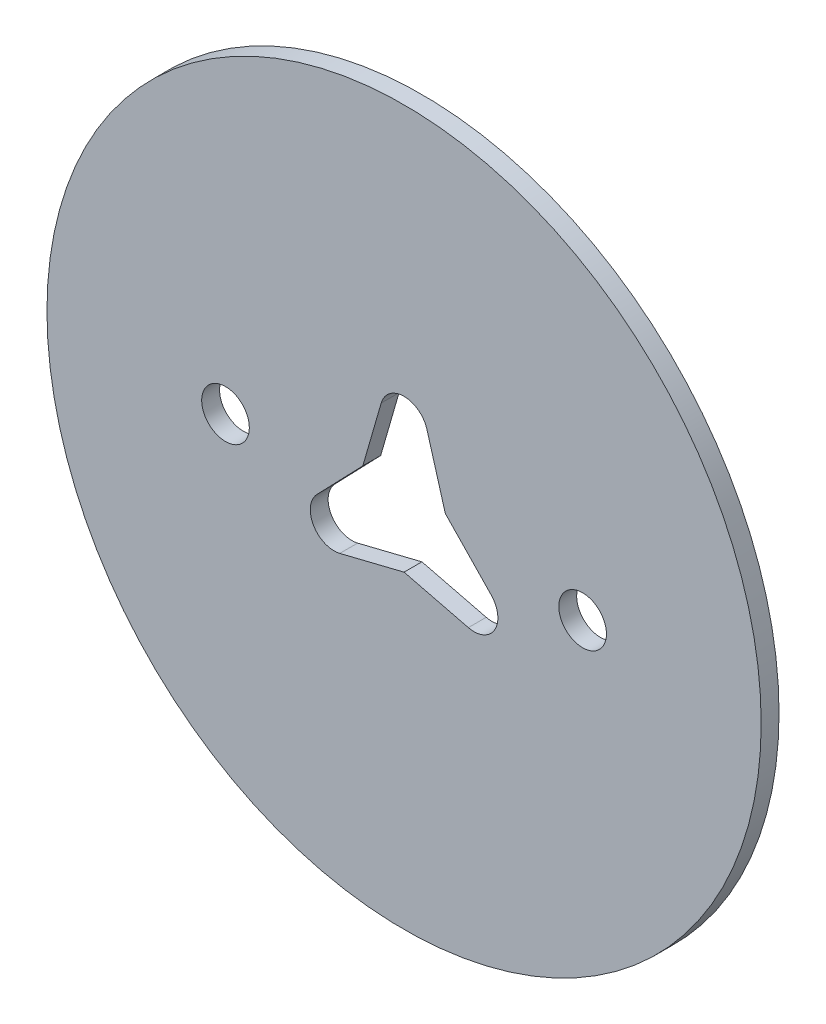
ISO-10303-21;
HEADER;
FILE_DESCRIPTION(('STEP AP214'),'2;1');
FILE_NAME('part.step','',(''),(''),'','','');
FILE_SCHEMA(('AUTOMOTIVE_DESIGN { 1 0 10303 214 1 1 1 1 }'));
ENDSEC;
DATA;
#1=APPLICATION_CONTEXT('core data for automotive mechanical design processes');
#2=APPLICATION_PROTOCOL_DEFINITION('international standard','automotive_design',2000,#1);
#3=PRODUCT_CONTEXT('',#1,'mechanical');
#4=PRODUCT('Part','Part','',(#3));
#5=PRODUCT_RELATED_PRODUCT_CATEGORY('part','',(#4));
#6=PRODUCT_DEFINITION_FORMATION('','',#4);
#7=PRODUCT_DEFINITION_CONTEXT('part definition',#1,'design');
#8=PRODUCT_DEFINITION('design','',#6,#7);
#9=PRODUCT_DEFINITION_SHAPE('','',#8);
#10=(LENGTH_UNIT() NAMED_UNIT(*) SI_UNIT(.MILLI.,.METRE.));
#11=(NAMED_UNIT(*) PLANE_ANGLE_UNIT() SI_UNIT($,.RADIAN.));
#12=(NAMED_UNIT(*) SI_UNIT($,.STERADIAN.) SOLID_ANGLE_UNIT());
#13=UNCERTAINTY_MEASURE_WITH_UNIT(LENGTH_MEASURE(1.E-05),#10,'distance_accuracy_value','');
#14=(GEOMETRIC_REPRESENTATION_CONTEXT(3) GLOBAL_UNCERTAINTY_ASSIGNED_CONTEXT((#13)) GLOBAL_UNIT_ASSIGNED_CONTEXT((#10,
#11,#12)) REPRESENTATION_CONTEXT('',''));
#15=CARTESIAN_POINT('',(0.,0.,0.));
#16=DIRECTION('',(0.,0.,1.));
#17=DIRECTION('',(1.,0.,0.));
#18=AXIS2_PLACEMENT_3D('',#15,#16,#17);
#19=CARTESIAN_POINT('',(0.,0.,1.5));
#20=DIRECTION('',(0.,0.,1.));
#21=DIRECTION('',(1.,0.,0.));
#22=AXIS2_PLACEMENT_3D('',#19,#20,#21);
#23=PLANE('',#22);
#24=CARTESIAN_POINT('',(-15.,0.,1.5));
#25=DIRECTION('',(0.,0.,1.));
#26=DIRECTION('',(1.,0.,0.));
#27=AXIS2_PLACEMENT_3D('',#24,#25,#26);
#28=CIRCLE('',#27,2.);
#29=CARTESIAN_POINT('',(-13.,0.,1.5));
#30=VERTEX_POINT('',#29);
#31=EDGE_CURVE('E159',#30,#30,#28,.T.);
#32=ORIENTED_EDGE('',*,*,#31,.F.);
#33=EDGE_LOOP('',(#32));
#34=FACE_BOUND('',#33,.T.);
#35=CARTESIAN_POINT('',(0.,0.,1.5));
#36=DIRECTION('',(0.,0.,1.));
#37=DIRECTION('',(1.,0.,0.));
#38=AXIS2_PLACEMENT_3D('',#35,#36,#37);
#39=CIRCLE('',#38,30.);
#40=CARTESIAN_POINT('',(30.,0.,1.5));
#41=VERTEX_POINT('',#40);
#42=EDGE_CURVE('E165',#41,#41,#39,.T.);
#43=ORIENTED_EDGE('',*,*,#42,.T.);
#44=EDGE_LOOP('',(#43));
#45=FACE_BOUND('',#44,.T.);
#46=CARTESIAN_POINT('',(15.,0.,1.5));
#47=DIRECTION('',(0.,0.,1.));
#48=DIRECTION('',(1.,0.,0.));
#49=AXIS2_PLACEMENT_3D('',#46,#47,#48);
#50=CIRCLE('',#49,2.);
#51=CARTESIAN_POINT('',(17.,0.,1.5));
#52=VERTEX_POINT('',#51);
#53=EDGE_CURVE('E153',#52,#52,#50,.T.);
#54=ORIENTED_EDGE('',*,*,#53,.F.);
#55=EDGE_LOOP('',(#54));
#56=FACE_BOUND('',#55,.T.);
#57=DIRECTION('',(0.97072534339415,0.240192230707636,0.));
#58=VECTOR('',#57,1.);
#59=CARTESIAN_POINT('',(0.932642742537106,-3.76923076923076,1.5));
#60=LINE('',#59,#58);
#61=CARTESIAN_POINT('',(-5.39897319316845,-5.33589941132433,1.5));
#62=VERTEX_POINT('',#61);
#63=CARTESIAN_POINT('',(0.,-4.,1.5));
#64=VERTEX_POINT('',#63);
#65=EDGE_CURVE('E120',#62,#64,#60,.T.);
#66=ORIENTED_EDGE('',*,*,#65,.F.);
#67=CARTESIAN_POINT('',(-5.87935765458372,-3.39444872453603,1.5));
#68=DIRECTION('',(0.,0.,1.));
#69=DIRECTION('',(1.,0.,0.));
#70=AXIS2_PLACEMENT_3D('',#67,#68,#69);
#71=CIRCLE('',#70,2.);
#72=CARTESIAN_POINT('',(-7.32051103882952,-2.00769823397297,1.5));
#73=VERTEX_POINT('',#72);
#74=EDGE_CURVE('E187',#62,#73,#71,.F.);
#75=ORIENTED_EDGE('',*,*,#74,.T.);
#76=DIRECTION('',(0.693375245281533,0.720576692122896,0.));
#77=VECTOR('',#76,1.);
#78=CARTESIAN_POINT('',(-2.79792822761128,2.69230769230768,1.5));
#79=LINE('',#78,#77);
#80=CARTESIAN_POINT('',(-3.46410161513776,1.99999999999999,1.5));
#81=VERTEX_POINT('',#80);
#82=EDGE_CURVE('E150',#73,#81,#79,.T.);
#83=ORIENTED_EDGE('',*,*,#82,.T.);
#84=DIRECTION('',(0.277350098112615,0.960768922830523,0.));
#85=VECTOR('',#84,1.);
#86=CARTESIAN_POINT('',(-3.73057097014835,1.07692307692308,1.5));
#87=LINE('',#86,#85);
#88=CARTESIAN_POINT('',(-1.92153784566104,7.34359764529726,1.5));
#89=VERTEX_POINT('',#88);
#90=EDGE_CURVE('E121',#81,#89,#87,.T.);
#91=ORIENTED_EDGE('',*,*,#90,.T.);
#92=CARTESIAN_POINT('',(0.,6.78889744907202,1.5));
#93=DIRECTION('',(0.,0.,1.));
#94=DIRECTION('',(1.,0.,0.));
#95=AXIS2_PLACEMENT_3D('',#92,#93,#94);
#96=CIRCLE('',#95,2.);
#97=CARTESIAN_POINT('',(1.92153784566105,7.34359764529726,1.5));
#98=VERTEX_POINT('',#97);
#99=EDGE_CURVE('E11',#89,#98,#96,.F.);
#100=ORIENTED_EDGE('',*,*,#99,.T.);
#101=DIRECTION('',(0.277350098112615,-0.960768922830523,0.));
#102=VECTOR('',#101,1.);
#103=CARTESIAN_POINT('',(3.73057097014835,1.07692307692308,1.5));
#104=LINE('',#103,#102);
#105=CARTESIAN_POINT('',(3.46410161513776,1.99999999999999,1.5));
#106=VERTEX_POINT('',#105);
#107=EDGE_CURVE('E142',#98,#106,#104,.T.);
#108=ORIENTED_EDGE('',*,*,#107,.T.);
#109=DIRECTION('',(0.693375245281533,-0.720576692122896,0.));
#110=VECTOR('',#109,1.);
#111=CARTESIAN_POINT('',(2.79792822761128,2.69230769230768,1.5));
#112=LINE('',#111,#110);
#113=CARTESIAN_POINT('',(7.32051103882952,-2.00769823397297,1.5));
#114=VERTEX_POINT('',#113);
#115=EDGE_CURVE('E144',#106,#114,#112,.T.);
#116=ORIENTED_EDGE('',*,*,#115,.T.);
#117=CARTESIAN_POINT('',(5.87935765458372,-3.39444872453604,1.5));
#118=DIRECTION('',(0.,0.,1.));
#119=DIRECTION('',(1.,0.,0.));
#120=AXIS2_PLACEMENT_3D('',#117,#118,#119);
#121=CIRCLE('',#120,2.);
#122=CARTESIAN_POINT('',(5.39897319316845,-5.33589941132434,1.5));
#123=VERTEX_POINT('',#122);
#124=EDGE_CURVE('E184',#114,#123,#121,.F.);
#125=ORIENTED_EDGE('',*,*,#124,.T.);
#126=DIRECTION('',(0.97072534339415,-0.240192230707636,0.));
#127=VECTOR('',#126,1.);
#128=CARTESIAN_POINT('',(-0.932642742537106,-3.76923076923076,1.5));
#129=LINE('',#128,#127);
#130=EDGE_CURVE('E147',#64,#123,#129,.T.);
#131=ORIENTED_EDGE('',*,*,#130,.F.);
#132=EDGE_LOOP('',(#66,#75,#83,#91,#100,#108,#116,#125,#131));
#133=FACE_BOUND('',#132,.T.);
#134=ADVANCED_FACE('F32',(#34,#45,#56,#133),#23,.T.);
#135=CARTESIAN_POINT('',(0.,0.,0.));
#136=DIRECTION('',(0.,0.,1.));
#137=DIRECTION('',(1.,0.,0.));
#138=AXIS2_PLACEMENT_3D('',#135,#136,#137);
#139=PLANE('',#138);
#140=CARTESIAN_POINT('',(15.,0.,0.));
#141=DIRECTION('',(0.,0.,1.));
#142=DIRECTION('',(1.,0.,0.));
#143=AXIS2_PLACEMENT_3D('',#140,#141,#142);
#144=CIRCLE('',#143,2.);
#145=CARTESIAN_POINT('',(17.,0.,0.));
#146=VERTEX_POINT('',#145);
#147=EDGE_CURVE('E152',#146,#146,#144,.T.);
#148=ORIENTED_EDGE('',*,*,#147,.T.);
#149=EDGE_LOOP('',(#148));
#150=FACE_BOUND('',#149,.T.);
#151=CARTESIAN_POINT('',(-15.,0.,0.));
#152=DIRECTION('',(0.,0.,1.));
#153=DIRECTION('',(1.,0.,0.));
#154=AXIS2_PLACEMENT_3D('',#151,#152,#153);
#155=CIRCLE('',#154,2.);
#156=CARTESIAN_POINT('',(-13.,0.,0.));
#157=VERTEX_POINT('',#156);
#158=EDGE_CURVE('E156',#157,#157,#155,.T.);
#159=ORIENTED_EDGE('',*,*,#158,.T.);
#160=EDGE_LOOP('',(#159));
#161=FACE_BOUND('',#160,.T.);
#162=CARTESIAN_POINT('',(0.,0.,0.));
#163=DIRECTION('',(0.,0.,1.));
#164=DIRECTION('',(1.,0.,0.));
#165=AXIS2_PLACEMENT_3D('',#162,#163,#164);
#166=CIRCLE('',#165,30.);
#167=CARTESIAN_POINT('',(30.,0.,0.));
#168=VERTEX_POINT('',#167);
#169=EDGE_CURVE('E162',#168,#168,#166,.T.);
#170=ORIENTED_EDGE('',*,*,#169,.F.);
#171=EDGE_LOOP('',(#170));
#172=FACE_BOUND('',#171,.T.);
#173=DIRECTION('',(-0.693375245281533,-0.720576692122896,0.));
#174=VECTOR('',#173,1.);
#175=CARTESIAN_POINT('',(-3.46410161513776,1.99999999999999,0.));
#176=LINE('',#175,#174);
#177=CARTESIAN_POINT('',(-3.46410161513776,1.99999999999999,0.));
#178=VERTEX_POINT('',#177);
#179=CARTESIAN_POINT('',(-7.32051103882952,-2.00769823397297,0.));
#180=VERTEX_POINT('',#179);
#181=EDGE_CURVE('E127',#178,#180,#176,.T.);
#182=ORIENTED_EDGE('',*,*,#181,.T.);
#183=CARTESIAN_POINT('',(-5.87935765458372,-3.39444872453603,0.));
#184=DIRECTION('',(0.,0.,1.));
#185=DIRECTION('',(1.,0.,0.));
#186=AXIS2_PLACEMENT_3D('',#183,#184,#185);
#187=CIRCLE('',#186,2.);
#188=CARTESIAN_POINT('',(-5.39897319316845,-5.33589941132433,0.));
#189=VERTEX_POINT('',#188);
#190=EDGE_CURVE('E126',#180,#189,#187,.T.);
#191=ORIENTED_EDGE('',*,*,#190,.T.);
#192=DIRECTION('',(-0.97072534339415,-0.240192230707636,0.));
#193=VECTOR('',#192,1.);
#194=CARTESIAN_POINT('',(0.,-4.,0.));
#195=LINE('',#194,#193);
#196=CARTESIAN_POINT('',(0.,-4.,0.));
#197=VERTEX_POINT('',#196);
#198=EDGE_CURVE('E113',#197,#189,#195,.T.);
#199=ORIENTED_EDGE('',*,*,#198,.F.);
#200=DIRECTION('',(-0.97072534339415,0.240192230707636,0.));
#201=VECTOR('',#200,1.);
#202=CARTESIAN_POINT('',(12.1243556529821,-7.00000000000006,0.));
#203=LINE('',#202,#201);
#204=CARTESIAN_POINT('',(5.39897319316845,-5.33589941132434,0.));
#205=VERTEX_POINT('',#204);
#206=EDGE_CURVE('E103',#205,#197,#203,.T.);
#207=ORIENTED_EDGE('',*,*,#206,.F.);
#208=CARTESIAN_POINT('',(5.87935765458372,-3.39444872453604,0.));
#209=DIRECTION('',(0.,0.,1.));
#210=DIRECTION('',(1.,0.,0.));
#211=AXIS2_PLACEMENT_3D('',#208,#209,#210);
#212=CIRCLE('',#211,2.);
#213=CARTESIAN_POINT('',(7.32051103882952,-2.00769823397297,0.));
#214=VERTEX_POINT('',#213);
#215=EDGE_CURVE('E182',#205,#214,#212,.T.);
#216=ORIENTED_EDGE('',*,*,#215,.T.);
#217=DIRECTION('',(-0.693375245281533,0.720576692122896,0.));
#218=VECTOR('',#217,1.);
#219=CARTESIAN_POINT('',(12.1243556529821,-7.00000000000006,0.));
#220=LINE('',#219,#218);
#221=CARTESIAN_POINT('',(3.46410161513776,1.99999999999999,0.));
#222=VERTEX_POINT('',#221);
#223=EDGE_CURVE('E112',#214,#222,#220,.T.);
#224=ORIENTED_EDGE('',*,*,#223,.T.);
#225=DIRECTION('',(-0.277350098112615,0.960768922830523,0.));
#226=VECTOR('',#225,1.);
#227=CARTESIAN_POINT('',(3.46410161513776,1.99999999999999,0.));
#228=LINE('',#227,#226);
#229=CARTESIAN_POINT('',(1.92153784566105,7.34359764529726,0.));
#230=VERTEX_POINT('',#229);
#231=EDGE_CURVE('E132',#222,#230,#228,.T.);
#232=ORIENTED_EDGE('',*,*,#231,.T.);
#233=CARTESIAN_POINT('',(0.,6.78889744907202,0.));
#234=DIRECTION('',(0.,0.,1.));
#235=DIRECTION('',(1.,0.,0.));
#236=AXIS2_PLACEMENT_3D('',#233,#234,#235);
#237=CIRCLE('',#236,2.);
#238=CARTESIAN_POINT('',(-1.92153784566105,7.34359764529726,0.));
#239=VERTEX_POINT('',#238);
#240=EDGE_CURVE('E40',#230,#239,#237,.T.);
#241=ORIENTED_EDGE('',*,*,#240,.T.);
#242=DIRECTION('',(-0.277350098112615,-0.960768922830523,0.));
#243=VECTOR('',#242,1.);
#244=CARTESIAN_POINT('',(0.,14.,0.));
#245=LINE('',#244,#243);
#246=EDGE_CURVE('E134',#239,#178,#245,.T.);
#247=ORIENTED_EDGE('',*,*,#246,.T.);
#248=EDGE_LOOP('',(#182,#191,#199,#207,#216,#224,#232,#241,#247));
#249=FACE_BOUND('',#248,.T.);
#250=ADVANCED_FACE('F125',(#150,#161,#172,#249),#139,.F.);
#251=CARTESIAN_POINT('',(0.,0.,1.5));
#252=DIRECTION('',(0.,0.,-1.));
#253=DIRECTION('',(-1.,0.,0.));
#254=AXIS2_PLACEMENT_3D('',#251,#252,#253);
#255=CYLINDRICAL_SURFACE('',#254,30.);
#256=ORIENTED_EDGE('',*,*,#42,.F.);
#257=EDGE_LOOP('',(#256));
#258=FACE_BOUND('',#257,.T.);
#259=ORIENTED_EDGE('',*,*,#169,.T.);
#260=EDGE_LOOP('',(#259));
#261=FACE_BOUND('',#260,.T.);
#262=ADVANCED_FACE('F214',(#258,#261),#255,.T.);
#263=CARTESIAN_POINT('',(-15.,0.,1.5));
#264=DIRECTION('',(0.,0.,-1.));
#265=DIRECTION('',(-1.,0.,0.));
#266=AXIS2_PLACEMENT_3D('',#263,#264,#265);
#267=CYLINDRICAL_SURFACE('',#266,2.);
#268=ORIENTED_EDGE('',*,*,#31,.T.);
#269=EDGE_LOOP('',(#268));
#270=FACE_BOUND('',#269,.T.);
#271=ORIENTED_EDGE('',*,*,#158,.F.);
#272=EDGE_LOOP('',(#271));
#273=FACE_BOUND('',#272,.T.);
#274=ADVANCED_FACE('F220',(#270,#273),#267,.F.);
#275=CARTESIAN_POINT('',(15.,0.,1.5));
#276=DIRECTION('',(0.,0.,-1.));
#277=DIRECTION('',(-1.,0.,0.));
#278=AXIS2_PLACEMENT_3D('',#275,#276,#277);
#279=CYLINDRICAL_SURFACE('',#278,2.);
#280=ORIENTED_EDGE('',*,*,#53,.T.);
#281=EDGE_LOOP('',(#280));
#282=FACE_BOUND('',#281,.T.);
#283=ORIENTED_EDGE('',*,*,#147,.F.);
#284=EDGE_LOOP('',(#283));
#285=FACE_BOUND('',#284,.T.);
#286=ADVANCED_FACE('F228',(#282,#285),#279,.F.);
#287=CARTESIAN_POINT('',(-3.46410161513776,1.99999999999999,10.));
#288=DIRECTION('',(0.720576692122896,-0.693375245281533,0.));
#289=DIRECTION('',(0.693375245281533,0.720576692122896,0.));
#290=AXIS2_PLACEMENT_3D('',#287,#288,#289);
#291=PLANE('',#290);
#292=ORIENTED_EDGE('',*,*,#82,.F.);
#293=DIRECTION('',(0.,0.,-1.));
#294=VECTOR('',#293,1.);
#295=CARTESIAN_POINT('',(-7.32051103882952,-2.00769823397297,10.));
#296=LINE('',#295,#294);
#297=EDGE_CURVE('E173',#73,#180,#296,.T.);
#298=ORIENTED_EDGE('',*,*,#297,.T.);
#299=ORIENTED_EDGE('',*,*,#181,.F.);
#300=DIRECTION('',(0.,0.,-1.));
#301=VECTOR('',#300,1.);
#302=CARTESIAN_POINT('',(-3.46410161513776,1.99999999999999,10.));
#303=LINE('',#302,#301);
#304=EDGE_CURVE('E136',#81,#178,#303,.T.);
#305=ORIENTED_EDGE('',*,*,#304,.F.);
#306=EDGE_LOOP('',(#292,#298,#299,#305));
#307=FACE_BOUND('',#306,.T.);
#308=ADVANCED_FACE('F195',(#307),#291,.T.);
#309=CARTESIAN_POINT('',(0.,-4.,10.));
#310=DIRECTION('',(0.240192230707636,-0.97072534339415,0.));
#311=DIRECTION('',(0.97072534339415,0.240192230707636,0.));
#312=AXIS2_PLACEMENT_3D('',#309,#310,#311);
#313=PLANE('',#312);
#314=ORIENTED_EDGE('',*,*,#198,.T.);
#315=DIRECTION('',(0.,0.,-1.));
#316=VECTOR('',#315,1.);
#317=CARTESIAN_POINT('',(-5.39897319316845,-5.33589941132433,10.));
#318=LINE('',#317,#316);
#319=EDGE_CURVE('E176',#189,#62,#318,.F.);
#320=ORIENTED_EDGE('',*,*,#319,.T.);
#321=ORIENTED_EDGE('',*,*,#65,.T.);
#322=DIRECTION('',(0.,0.,-1.));
#323=VECTOR('',#322,1.);
#324=CARTESIAN_POINT('',(0.,-4.,10.));
#325=LINE('',#324,#323);
#326=EDGE_CURVE('E107',#64,#197,#325,.T.);
#327=ORIENTED_EDGE('',*,*,#326,.T.);
#328=EDGE_LOOP('',(#314,#320,#321,#327));
#329=FACE_BOUND('',#328,.T.);
#330=ADVANCED_FACE('F117',(#329),#313,.F.);
#331=CARTESIAN_POINT('',(12.1243556529821,-7.00000000000006,10.));
#332=DIRECTION('',(-0.240192230707636,-0.97072534339415,0.));
#333=DIRECTION('',(0.97072534339415,-0.240192230707636,0.));
#334=AXIS2_PLACEMENT_3D('',#331,#332,#333);
#335=PLANE('',#334);
#336=ORIENTED_EDGE('',*,*,#130,.T.);
#337=DIRECTION('',(0.,0.,-1.));
#338=VECTOR('',#337,1.);
#339=CARTESIAN_POINT('',(5.39897319316845,-5.33589941132434,10.));
#340=LINE('',#339,#338);
#341=EDGE_CURVE('E110',#123,#205,#340,.T.);
#342=ORIENTED_EDGE('',*,*,#341,.T.);
#343=ORIENTED_EDGE('',*,*,#206,.T.);
#344=ORIENTED_EDGE('',*,*,#326,.F.);
#345=EDGE_LOOP('',(#336,#342,#343,#344));
#346=FACE_BOUND('',#345,.T.);
#347=ADVANCED_FACE('F106',(#346),#335,.F.);
#348=CARTESIAN_POINT('',(12.1243556529821,-7.00000000000006,10.));
#349=DIRECTION('',(-0.720576692122896,-0.693375245281533,0.));
#350=DIRECTION('',(0.693375245281533,-0.720576692122896,0.));
#351=AXIS2_PLACEMENT_3D('',#348,#349,#350);
#352=PLANE('',#351);
#353=ORIENTED_EDGE('',*,*,#223,.F.);
#354=DIRECTION('',(0.,0.,-1.));
#355=VECTOR('',#354,1.);
#356=CARTESIAN_POINT('',(7.32051103882952,-2.00769823397297,10.));
#357=LINE('',#356,#355);
#358=EDGE_CURVE('E171',#214,#114,#357,.F.);
#359=ORIENTED_EDGE('',*,*,#358,.T.);
#360=ORIENTED_EDGE('',*,*,#115,.F.);
#361=DIRECTION('',(0.,0.,-1.));
#362=VECTOR('',#361,1.);
#363=CARTESIAN_POINT('',(3.46410161513776,1.99999999999999,10.));
#364=LINE('',#363,#362);
#365=EDGE_CURVE('E122',#106,#222,#364,.T.);
#366=ORIENTED_EDGE('',*,*,#365,.T.);
#367=EDGE_LOOP('',(#353,#359,#360,#366));
#368=FACE_BOUND('',#367,.T.);
#369=ADVANCED_FACE('F252',(#368),#352,.T.);
#370=CARTESIAN_POINT('',(3.46410161513776,1.99999999999999,10.));
#371=DIRECTION('',(-0.960768922830523,-0.277350098112615,0.));
#372=DIRECTION('',(0.277350098112615,-0.960768922830523,0.));
#373=AXIS2_PLACEMENT_3D('',#370,#371,#372);
#374=PLANE('',#373);
#375=ORIENTED_EDGE('',*,*,#107,.F.);
#376=DIRECTION('',(0.,0.,-1.));
#377=VECTOR('',#376,1.);
#378=CARTESIAN_POINT('',(1.92153784566105,7.34359764529725,0.));
#379=LINE('',#378,#377);
#380=EDGE_CURVE('E178',#98,#230,#379,.T.);
#381=ORIENTED_EDGE('',*,*,#380,.T.);
#382=ORIENTED_EDGE('',*,*,#231,.F.);
#383=ORIENTED_EDGE('',*,*,#365,.F.);
#384=EDGE_LOOP('',(#375,#381,#382,#383));
#385=FACE_BOUND('',#384,.T.);
#386=ADVANCED_FACE('F255',(#385),#374,.T.);
#387=CARTESIAN_POINT('',(0.,14.,10.));
#388=DIRECTION('',(0.960768922830523,-0.277350098112615,0.));
#389=DIRECTION('',(0.277350098112615,0.960768922830523,0.));
#390=AXIS2_PLACEMENT_3D('',#387,#388,#389);
#391=PLANE('',#390);
#392=ORIENTED_EDGE('',*,*,#246,.F.);
#393=DIRECTION('',(0.,0.,-1.));
#394=VECTOR('',#393,1.);
#395=CARTESIAN_POINT('',(-1.92153784566105,7.34359764529725,1.5));
#396=LINE('',#395,#394);
#397=EDGE_CURVE('E47',#239,#89,#396,.F.);
#398=ORIENTED_EDGE('',*,*,#397,.T.);
#399=ORIENTED_EDGE('',*,*,#90,.F.);
#400=ORIENTED_EDGE('',*,*,#304,.T.);
#401=EDGE_LOOP('',(#392,#398,#399,#400));
#402=FACE_BOUND('',#401,.T.);
#403=ADVANCED_FACE('F205',(#402),#391,.T.);
#404=CARTESIAN_POINT('',(5.87935765458372,-3.39444872453604,10.));
#405=DIRECTION('',(0.,0.,-1.));
#406=DIRECTION('',(-1.,0.,0.));
#407=AXIS2_PLACEMENT_3D('',#404,#405,#406);
#408=CYLINDRICAL_SURFACE('',#407,2.);
#409=ORIENTED_EDGE('',*,*,#124,.F.);
#410=ORIENTED_EDGE('',*,*,#358,.F.);
#411=ORIENTED_EDGE('',*,*,#215,.F.);
#412=ORIENTED_EDGE('',*,*,#341,.F.);
#413=EDGE_LOOP('',(#409,#410,#411,#412));
#414=FACE_BOUND('',#413,.T.);
#415=ADVANCED_FACE('F199',(#414),#408,.F.);
#416=CARTESIAN_POINT('',(-5.87935765458372,-3.39444872453603,10.));
#417=DIRECTION('',(0.,0.,-1.));
#418=DIRECTION('',(-1.,0.,0.));
#419=AXIS2_PLACEMENT_3D('',#416,#417,#418);
#420=CYLINDRICAL_SURFACE('',#419,2.);
#421=ORIENTED_EDGE('',*,*,#74,.F.);
#422=ORIENTED_EDGE('',*,*,#319,.F.);
#423=ORIENTED_EDGE('',*,*,#190,.F.);
#424=ORIENTED_EDGE('',*,*,#297,.F.);
#425=EDGE_LOOP('',(#421,#422,#423,#424));
#426=FACE_BOUND('',#425,.T.);
#427=ADVANCED_FACE('F197',(#426),#420,.F.);
#428=CARTESIAN_POINT('',(0.,6.78889744907202,10.));
#429=DIRECTION('',(0.,0.,1.));
#430=DIRECTION('',(1.,0.,0.));
#431=AXIS2_PLACEMENT_3D('',#428,#429,#430);
#432=CYLINDRICAL_SURFACE('',#431,2.);
#433=ORIENTED_EDGE('',*,*,#99,.F.);
#434=ORIENTED_EDGE('',*,*,#397,.F.);
#435=ORIENTED_EDGE('',*,*,#240,.F.);
#436=ORIENTED_EDGE('',*,*,#380,.F.);
#437=EDGE_LOOP('',(#433,#434,#435,#436));
#438=FACE_BOUND('',#437,.T.);
#439=ADVANCED_FACE('F34',(#438),#432,.F.);
#440=CLOSED_SHELL('',(#134,#250,#262,#274,#286,#308,#330,#347,#369,#386,#403,#415,#427,#439));
#441=MANIFOLD_SOLID_BREP('B2',#440);
#442=ADVANCED_BREP_SHAPE_REPRESENTATION('',(#18,#441),#14);
#443=SHAPE_DEFINITION_REPRESENTATION(#9,#442);
ENDSEC;
END-ISO-10303-21;
